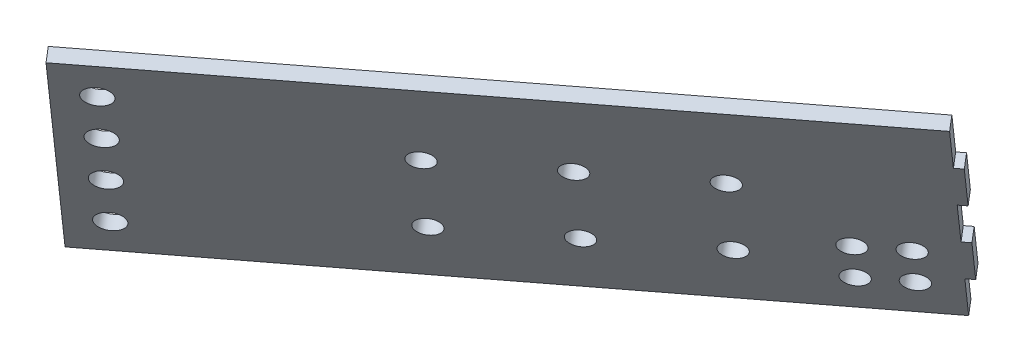
ISO-10303-21;
HEADER;
FILE_DESCRIPTION(('STEP AP214'),'2;1');
FILE_NAME('part.step','',(''),(''),'','','');
FILE_SCHEMA(('AUTOMOTIVE_DESIGN { 1 0 10303 214 1 1 1 1 }'));
ENDSEC;
DATA;
#1=APPLICATION_CONTEXT('core data for automotive mechanical design processes');
#2=APPLICATION_PROTOCOL_DEFINITION('international standard','automotive_design',2000,#1);
#3=PRODUCT_CONTEXT('',#1,'mechanical');
#4=PRODUCT('Part','Part','',(#3));
#5=PRODUCT_RELATED_PRODUCT_CATEGORY('part','',(#4));
#6=PRODUCT_DEFINITION_FORMATION('','',#4);
#7=PRODUCT_DEFINITION_CONTEXT('part definition',#1,'design');
#8=PRODUCT_DEFINITION('design','',#6,#7);
#9=PRODUCT_DEFINITION_SHAPE('','',#8);
#10=(LENGTH_UNIT() NAMED_UNIT(*) SI_UNIT(.MILLI.,.METRE.));
#11=(NAMED_UNIT(*) PLANE_ANGLE_UNIT() SI_UNIT($,.RADIAN.));
#12=(NAMED_UNIT(*) SI_UNIT($,.STERADIAN.) SOLID_ANGLE_UNIT());
#13=UNCERTAINTY_MEASURE_WITH_UNIT(LENGTH_MEASURE(1.E-05),#10,'distance_accuracy_value','');
#14=(GEOMETRIC_REPRESENTATION_CONTEXT(3) GLOBAL_UNCERTAINTY_ASSIGNED_CONTEXT((#13)) GLOBAL_UNIT_ASSIGNED_CONTEXT((#10,
#11,#12)) REPRESENTATION_CONTEXT('',''));
#15=CARTESIAN_POINT('',(0.,0.,0.));
#16=DIRECTION('',(0.,0.,1.));
#17=DIRECTION('',(1.,0.,0.));
#18=AXIS2_PLACEMENT_3D('',#15,#16,#17);
#19=CARTESIAN_POINT('',(-14.5467046392581,44.45,-33.02));
#20=DIRECTION('',(-0.79335334029123,0.,0.608761429008727));
#21=DIRECTION('',(-0.247605580069034,-0.913545457642603,-0.322685874403024));
#22=AXIS2_PLACEMENT_3D('',#19,#20,#21);
#23=PLANE('',#22);
#24=DIRECTION('',(-0.556131238258943,0.406736643075794,-0.72476434032864));
#25=VECTOR('',#24,1.);
#26=CARTESIAN_POINT('',(-8.75342284130713,36.2336291981627,-25.4700481688912));
#27=LINE('',#26,#25);
#28=CARTESIAN_POINT('',(-15.4468292939168,41.1289731097893,-34.193065288671));
#29=VERTEX_POINT('',#28);
#30=CARTESIAN_POINT('',(-17.1136658412265,42.3480441764161,-36.365328969504));
#31=VERTEX_POINT('',#30);
#32=EDGE_CURVE('E149',#29,#31,#27,.T.);
#33=ORIENTED_EDGE('',*,*,#32,.T.);
#34=DIRECTION('',(0.247605580069033,0.913545457642604,0.322685874403023));
#35=VECTOR('',#34,1.);
#36=CARTESIAN_POINT('',(-22.7379885264077,21.5969995516098,-43.6950889978784));
#37=LINE('',#36,#35);
#38=CARTESIAN_POINT('',(-14.3267866664418,52.6302874538634,-32.733397317882));
#39=VERTEX_POINT('',#38);
#40=EDGE_CURVE('E178',#39,#31,#37,.F.);
#41=ORIENTED_EDGE('',*,*,#40,.F.);
#42=DIRECTION('',(0.556131238258943,-0.406736643075794,0.72476434032864));
#43=VECTOR('',#42,1.);
#44=CARTESIAN_POINT('',(-12.6599501191321,51.4112163872367,-30.561133637049));
#45=LINE('',#44,#43);
#46=CARTESIAN_POINT('',(-12.6599501191321,51.4112163872367,-30.561133637049));
#47=VERTEX_POINT('',#46);
#48=EDGE_CURVE('E53',#39,#47,#45,.T.);
#49=ORIENTED_EDGE('',*,*,#48,.T.);
#50=DIRECTION('',(-0.247605580069034,-0.913545457642603,-0.322685874403024));
#51=VECTOR('',#50,1.);
#52=CARTESIAN_POINT('',(-14.5467046392581,44.45,-33.02));
#53=LINE('',#52,#51);
#54=EDGE_CURVE('E142',#47,#29,#53,.T.);
#55=ORIENTED_EDGE('',*,*,#54,.T.);
#56=EDGE_LOOP('',(#33,#41,#49,#55));
#57=FACE_BOUND('',#56,.T.);
#58=ADVANCED_FACE('F43',(#57),#23,.F.);
#59=DIRECTION('',(-0.556131238258943,0.406736643075794,-0.72476434032864));
#60=VECTOR('',#59,1.);
#61=CARTESIAN_POINT('',(-11.5403020160918,25.9513859207153,-29.1019798205133));
#62=LINE('',#61,#60);
#63=CARTESIAN_POINT('',(-18.2337084687014,30.846729832342,-37.8249969402931));
#64=VERTEX_POINT('',#63);
#65=CARTESIAN_POINT('',(-19.9005450160111,32.0658008989688,-39.9972606211261));
#66=VERTEX_POINT('',#65);
#67=EDGE_CURVE('E222',#64,#66,#62,.T.);
#68=ORIENTED_EDGE('',*,*,#67,.F.);
#69=CARTESIAN_POINT('',(-21.020587643486,20.5644865548946,-41.4569285919151));
#70=VERTEX_POINT('',#69);
#71=EDGE_CURVE('E47',#64,#70,#53,.T.);
#72=ORIENTED_EDGE('',*,*,#71,.T.);
#73=DIRECTION('',(-0.556131238258943,0.406736643075794,-0.72476434032864));
#74=VECTOR('',#73,1.);
#75=CARTESIAN_POINT('',(-14.3271811908764,15.669142643268,-32.7339114721353));
#76=LINE('',#75,#74);
#77=CARTESIAN_POINT('',(-22.6874241907957,21.7835576215214,-43.6291922727481));
#78=VERTEX_POINT('',#77);
#79=EDGE_CURVE('E205',#70,#78,#76,.T.);
#80=ORIENTED_EDGE('',*,*,#79,.T.);
#81=EDGE_CURVE('E180',#66,#78,#37,.F.);
#82=ORIENTED_EDGE('',*,*,#81,.F.);
#83=EDGE_LOOP('',(#68,#72,#80,#82));
#84=FACE_BOUND('',#83,.T.);
#85=ADVANCED_FACE('F357',(#84),#23,.F.);
#86=DIRECTION('',(-0.556131238258943,0.406736643075794,-0.72476434032864));
#87=VECTOR('',#86,1.);
#88=CARTESIAN_POINT('',(-17.114060365661,5.38689936582066,-36.3658431237573));
#89=LINE('',#88,#87);
#90=CARTESIAN_POINT('',(-23.8074668182706,10.2822432774473,-45.0888602435371));
#91=VERTEX_POINT('',#90);
#92=CARTESIAN_POINT('',(-25.4743033655803,11.5013143440741,-47.2611239243701));
#93=VERTEX_POINT('',#92);
#94=EDGE_CURVE('E202',#91,#93,#89,.T.);
#95=ORIENTED_EDGE('',*,*,#94,.F.);
#96=CARTESIAN_POINT('',(-26.5943459930553,0.,-48.7207918951591));
#97=VERTEX_POINT('',#96);
#98=EDGE_CURVE('E163',#91,#97,#53,.T.);
#99=ORIENTED_EDGE('',*,*,#98,.T.);
#100=DIRECTION('',(0.556131238258943,-0.406736643075794,0.72476434032864));
#101=VECTOR('',#100,1.);
#102=CARTESIAN_POINT('',(-26.5943459930553,0.,-48.7207918951591));
#103=LINE('',#102,#101);
#104=CARTESIAN_POINT('',(-28.261182540365,1.21907106662677,-50.8930555759921));
#105=VERTEX_POINT('',#104);
#106=EDGE_CURVE('E11',#105,#97,#103,.T.);
#107=ORIENTED_EDGE('',*,*,#106,.F.);
#108=EDGE_CURVE('E176',#93,#105,#37,.F.);
#109=ORIENTED_EDGE('',*,*,#108,.F.);
#110=EDGE_LOOP('',(#95,#99,#107,#109));
#111=FACE_BOUND('',#110,.T.);
#112=ADVANCED_FACE('F340',(#111),#23,.F.);
#113=CARTESIAN_POINT('',(-150.825537827718,51.4112163872366,75.4570506217247));
#114=DIRECTION('',(0.247605580069033,0.913545457642604,0.322685874403023));
#115=DIRECTION('',(-0.793353340291231,0.,0.608761429008727));
#116=AXIS2_PLACEMENT_3D('',#113,#114,#115);
#117=PLANE('',#116);
#118=DIRECTION('',(-0.556131238258943,0.406736643075795,-0.72476434032864));
#119=VECTOR('',#118,1.);
#120=CARTESIAN_POINT('',(31.9766845844257,-64.1354295160414,262.308313646661));
#121=LINE('',#120,#119);
#122=CARTESIAN_POINT('',(-126.010308613242,51.4112163872367,56.4156555325728));
#123=VERTEX_POINT('',#122);
#124=CARTESIAN_POINT('',(-127.677145160551,52.6302874538634,54.2433918517398));
#125=VERTEX_POINT('',#124);
#126=EDGE_CURVE('E197',#123,#125,#121,.T.);
#127=ORIENTED_EDGE('',*,*,#126,.F.);
#128=DIRECTION('',(-0.793353340291231,0.,0.608761429008727));
#129=VECTOR('',#128,1.);
#130=CARTESIAN_POINT('',(-150.825537827718,51.4112163872366,75.4570506217247));
#131=LINE('',#130,#129);
#132=EDGE_CURVE('E160',#47,#123,#131,.T.);
#133=ORIENTED_EDGE('',*,*,#132,.F.);
#134=ORIENTED_EDGE('',*,*,#48,.F.);
#135=DIRECTION('',(0.79335334029123,0.,-0.608761429008727));
#136=VECTOR('',#135,1.);
#137=CARTESIAN_POINT('',(-21.1183876367849,52.6302874538634,-27.5220186017536));
#138=LINE('',#137,#136);
#139=EDGE_CURVE('E179',#39,#125,#138,.F.);
#140=ORIENTED_EDGE('',*,*,#139,.T.);
#141=EDGE_LOOP('',(#127,#133,#134,#140));
#142=FACE_BOUND('',#141,.T.);
#143=ADVANCED_FACE('F379',(#142),#117,.T.);
#144=CARTESIAN_POINT('',(-33.3859469633983,0.,-43.5094131790307));
#145=DIRECTION('',(-0.247605580069033,-0.913545457642604,-0.322685874403023));
#146=DIRECTION('',(0.79335334029123,0.,-0.608761429008727));
#147=AXIS2_PLACEMENT_3D('',#144,#145,#146);
#148=PLANE('',#147);
#149=DIRECTION('',(0.79335334029123,0.,-0.608761429008727));
#150=VECTOR('',#149,1.);
#151=CARTESIAN_POINT('',(-35.052783510708,1.21907106662677,-45.6816768598637));
#152=LINE('',#151,#150);
#153=CARTESIAN_POINT('',(-141.611541034475,1.21907106662672,36.0837335936297));
#154=VERTEX_POINT('',#153);
#155=EDGE_CURVE('E173',#154,#105,#152,.T.);
#156=ORIENTED_EDGE('',*,*,#155,.T.);
#157=ORIENTED_EDGE('',*,*,#106,.T.);
#158=DIRECTION('',(0.79335334029123,0.,-0.608761429008727));
#159=VECTOR('',#158,1.);
#160=CARTESIAN_POINT('',(-33.3859469633983,0.,-43.5094131790307));
#161=LINE('',#160,#159);
#162=CARTESIAN_POINT('',(-139.944704487165,0.,38.2559972744627));
#163=VERTEX_POINT('',#162);
#164=EDGE_CURVE('E165',#163,#97,#161,.T.);
#165=ORIENTED_EDGE('',*,*,#164,.F.);
#166=DIRECTION('',(-0.556131238258943,0.406736643075795,-0.72476434032864));
#167=VECTOR('',#166,1.);
#168=CARTESIAN_POINT('',(18.0422887105026,-115.546645903278,244.14865538855));
#169=LINE('',#168,#167);
#170=EDGE_CURVE('E190',#163,#154,#169,.T.);
#171=ORIENTED_EDGE('',*,*,#170,.T.);
#172=EDGE_LOOP('',(#156,#157,#165,#171));
#173=FACE_BOUND('',#172,.T.);
#174=ADVANCED_FACE('F45',(#173),#148,.T.);
#175=CARTESIAN_POINT('',(-27.862752949441,20.3779284849831,-36.3114466009171));
#176=DIRECTION('',(0.556131238258943,-0.406736643075794,0.72476434032864));
#177=DIRECTION('',(0.79335334029123,0.,-0.608761429008727));
#178=AXIS2_PLACEMENT_3D('',#175,#176,#177);
#179=PLANE('',#178);
#180=CARTESIAN_POINT('',(-46.8476183837827,31.9778206395344,-15.2340051939125));
#181=DIRECTION('',(0.556131238258943,-0.406736643075794,0.72476434032864));
#182=DIRECTION('',(0.79335334029123,0.,-0.608761429008727));
#183=AXIS2_PLACEMENT_3D('',#180,#181,#182);
#184=CIRCLE('',#183,2.55269999999999);
#185=CARTESIAN_POINT('',(-44.8224253120213,31.9778206395344,-16.787990493743));
#186=VERTEX_POINT('',#185);
#187=EDGE_CURVE('E234',#186,#186,#184,.T.);
#188=ORIENTED_EDGE('',*,*,#187,.F.);
#189=EDGE_LOOP('',(#188));
#190=FACE_BOUND('',#189,.T.);
#191=CARTESIAN_POINT('',(-71.0225798720128,13.4145769402367,-7.10156887980129));
#192=DIRECTION('',(0.556131238258943,-0.406736643075794,0.72476434032864));
#193=DIRECTION('',(0.79335334029123,0.,-0.608761429008727));
#194=AXIS2_PLACEMENT_3D('',#191,#192,#193);
#195=CIRCLE('',#194,2.55269999999995);
#196=CARTESIAN_POINT('',(-68.9973868002514,13.4145769402367,-8.65555417963184));
#197=VERTEX_POINT('',#196);
#198=EDGE_CURVE('E239',#197,#197,#195,.T.);
#199=ORIENTED_EDGE('',*,*,#198,.F.);
#200=EDGE_LOOP('',(#199));
#201=FACE_BOUND('',#200,.T.);
#202=CARTESIAN_POINT('',(-85.1348502940503,31.9778206395344,14.1448211458456));
#203=DIRECTION('',(0.556131238258943,-0.406736643075794,0.72476434032864));
#204=DIRECTION('',(0.79335334029123,0.,-0.608761429008727));
#205=AXIS2_PLACEMENT_3D('',#202,#203,#204);
#206=CIRCLE('',#205,2.55269999999986);
#207=CARTESIAN_POINT('',(-83.109657222289,31.9778206395344,12.5908358460151));
#208=VERTEX_POINT('',#207);
#209=EDGE_CURVE('E242',#208,#208,#206,.T.);
#210=ORIENTED_EDGE('',*,*,#209,.F.);
#211=EDGE_LOOP('',(#210));
#212=FACE_BOUND('',#211,.T.);
#213=CARTESIAN_POINT('',(-65.9912344850101,31.9778206395344,-0.544591911931874));
#214=DIRECTION('',(0.556131238258943,-0.406736643075794,0.72476434032864));
#215=DIRECTION('',(0.79335334029123,0.,-0.608761429008727));
#216=AXIS2_PLACEMENT_3D('',#213,#214,#215);
#217=CIRCLE('',#216,2.55269999999995);
#218=CARTESIAN_POINT('',(-63.9660414132487,31.9778206395344,-2.09857721176242));
#219=VERTEX_POINT('',#218);
#220=EDGE_CURVE('E245',#219,#219,#217,.T.);
#221=ORIENTED_EDGE('',*,*,#220,.F.);
#222=EDGE_LOOP('',(#221));
#223=FACE_BOUND('',#222,.T.);
#224=CARTESIAN_POINT('',(-125.408956693522,31.325473742774,44.6821338187698));
#225=DIRECTION('',(0.556131238258943,-0.406736643075794,0.72476434032864));
#226=DIRECTION('',(0.79335334029123,0.,-0.608761429008727));
#227=AXIS2_PLACEMENT_3D('',#224,#225,#226);
#228=CIRCLE('',#227,2.79400000000009);
#229=CARTESIAN_POINT('',(-123.192327460748,31.325473742774,42.9812543861193));
#230=VERTEX_POINT('',#229);
#231=EDGE_CURVE('E248',#230,#230,#228,.T.);
#232=ORIENTED_EDGE('',*,*,#231,.F.);
#233=EDGE_LOOP('',(#232));
#234=FACE_BOUND('',#233,.T.);
#235=CARTESIAN_POINT('',(-128.553547560399,19.7234464307129,40.5840232138514));
#236=DIRECTION('',(0.556131238258943,-0.406736643075794,0.72476434032864));
#237=DIRECTION('',(0.79335334029123,0.,-0.608761429008727));
#238=AXIS2_PLACEMENT_3D('',#235,#236,#237);
#239=CIRCLE('',#238,2.79400000000003);
#240=CARTESIAN_POINT('',(-126.336918327625,19.7234464307129,38.8831437812009));
#241=VERTEX_POINT('',#240);
#242=EDGE_CURVE('E251',#241,#241,#239,.T.);
#243=ORIENTED_EDGE('',*,*,#242,.F.);
#244=EDGE_LOOP('',(#243));
#245=FACE_BOUND('',#244,.T.);
#246=CARTESIAN_POINT('',(-51.8789637707854,13.4145769402367,-21.7909821617819));
#247=DIRECTION('',(0.556131238258943,-0.406736643075794,0.72476434032864));
#248=DIRECTION('',(0.79335334029123,0.,-0.608761429008727));
#249=AXIS2_PLACEMENT_3D('',#246,#247,#248);
#250=CIRCLE('',#249,2.55269999999998);
#251=CARTESIAN_POINT('',(-49.853770699024,13.4145769402367,-23.3449674616124));
#252=VERTEX_POINT('',#251);
#253=EDGE_CURVE('E254',#252,#252,#250,.T.);
#254=ORIENTED_EDGE('',*,*,#253,.F.);
#255=EDGE_LOOP('',(#254));
#256=FACE_BOUND('',#255,.T.);
#257=CARTESIAN_POINT('',(-122.264365826645,42.9275010548351,48.7802444236881));
#258=DIRECTION('',(0.556131238258943,-0.406736643075794,0.72476434032864));
#259=DIRECTION('',(0.79335334029123,0.,-0.608761429008727));
#260=AXIS2_PLACEMENT_3D('',#257,#258,#259);
#261=CIRCLE('',#260,2.79400000000011);
#262=CARTESIAN_POINT('',(-120.047736593871,42.9275010548351,47.0793649910377));
#263=VERTEX_POINT('',#262);
#264=EDGE_CURVE('E257',#263,#263,#261,.T.);
#265=ORIENTED_EDGE('',*,*,#264,.F.);
#266=EDGE_LOOP('',(#265));
#267=FACE_BOUND('',#266,.T.);
#268=CARTESIAN_POINT('',(-30.6432056618001,8.29544952812365,-40.9585989698857));
#269=DIRECTION('',(0.556131238258943,-0.406736643075794,0.72476434032864));
#270=DIRECTION('',(0.79335334029123,0.,-0.608761429008727));
#271=AXIS2_PLACEMENT_3D('',#268,#269,#270);
#272=CIRCLE('',#271,2.55269999999989);
#273=CARTESIAN_POINT('',(-28.6180125900387,8.29544952812365,-42.5125842697162));
#274=VERTEX_POINT('',#273);
#275=EDGE_CURVE('E260',#274,#274,#272,.T.);
#276=ORIENTED_EDGE('',*,*,#275,.F.);
#277=EDGE_LOOP('',(#276));
#278=FACE_BOUND('',#277,.T.);
#279=CARTESIAN_POINT('',(-28.2847625116426,16.9969700121695,-37.8850160161969));
#280=DIRECTION('',(0.556131238258943,-0.406736643075794,0.72476434032864));
#281=DIRECTION('',(0.79335334029123,0.,-0.608761429008727));
#282=AXIS2_PLACEMENT_3D('',#279,#280,#281);
#283=CIRCLE('',#282,2.55269999999996);
#284=CARTESIAN_POINT('',(-26.2595694398812,16.9969700121695,-39.4390013160275));
#285=VERTEX_POINT('',#284);
#286=EDGE_CURVE('E263',#285,#285,#283,.T.);
#287=ORIENTED_EDGE('',*,*,#286,.F.);
#288=EDGE_LOOP('',(#287));
#289=FACE_BOUND('',#288,.T.);
#290=CARTESIAN_POINT('',(-90.1661947951034,13.4145769402367,7.5878434981631));
#291=DIRECTION('',(0.556131238258943,-0.406736643075794,0.72476434032864));
#292=DIRECTION('',(0.79335334029123,0.,-0.608761429008727));
#293=AXIS2_PLACEMENT_3D('',#290,#291,#292);
#294=CIRCLE('',#293,2.55270000000002);
#295=CARTESIAN_POINT('',(-88.1410017233419,13.4145769402367,6.03385819833252));
#296=VERTEX_POINT('',#295);
#297=EDGE_CURVE('E266',#296,#296,#294,.T.);
#298=ORIENTED_EDGE('',*,*,#297,.F.);
#299=EDGE_LOOP('',(#298));
#300=FACE_BOUND('',#299,.T.);
#301=CARTESIAN_POINT('',(-38.199896228074,8.29544952812365,-35.1601463585776));
#302=DIRECTION('',(0.556131238258943,-0.406736643075794,0.72476434032864));
#303=DIRECTION('',(0.79335334029123,0.,-0.608761429008727));
#304=AXIS2_PLACEMENT_3D('',#301,#302,#303);
#305=CIRCLE('',#304,2.55269999999989);
#306=CARTESIAN_POINT('',(-36.1747031563127,8.29544952812365,-36.7141316584081));
#307=VERTEX_POINT('',#306);
#308=EDGE_CURVE('E269',#307,#307,#305,.T.);
#309=ORIENTED_EDGE('',*,*,#308,.F.);
#310=EDGE_LOOP('',(#309));
#311=FACE_BOUND('',#310,.T.);
#312=CARTESIAN_POINT('',(-35.8414530779165,16.9969700121695,-32.0865634048888));
#313=DIRECTION('',(0.556131238258943,-0.406736643075794,0.72476434032864));
#314=DIRECTION('',(0.79335334029123,0.,-0.608761429008727));
#315=AXIS2_PLACEMENT_3D('',#312,#313,#314);
#316=CIRCLE('',#315,2.55269999999996);
#317=CARTESIAN_POINT('',(-33.8162600061552,16.9969700121695,-33.6405487047194));
#318=VERTEX_POINT('',#317);
#319=EDGE_CURVE('E272',#318,#318,#316,.T.);
#320=ORIENTED_EDGE('',*,*,#319,.F.);
#321=EDGE_LOOP('',(#320));
#322=FACE_BOUND('',#321,.T.);
#323=CARTESIAN_POINT('',(-131.698138427275,8.12141911865187,36.485912608933));
#324=DIRECTION('',(0.556131238258943,-0.406736643075794,0.72476434032864));
#325=DIRECTION('',(0.79335334029123,0.,-0.608761429008727));
#326=AXIS2_PLACEMENT_3D('',#323,#324,#325);
#327=CIRCLE('',#326,2.79399999999997);
#328=CARTESIAN_POINT('',(-129.481509194502,8.12141911865187,34.7850331762826));
#329=VERTEX_POINT('',#328);
#330=EDGE_CURVE('E275',#329,#329,#327,.T.);
#331=ORIENTED_EDGE('',*,*,#330,.F.);
#332=EDGE_LOOP('',(#331));
#333=FACE_BOUND('',#332,.T.);
#334=DIRECTION('',(0.247605580069033,0.913545457642604,0.322685874403023));
#335=VECTOR('',#334,1.);
#336=CARTESIAN_POINT('',(-134.421510473207,20.3779284849831,45.4539638525764));
#337=LINE('',#336,#335);
#338=EDGE_CURVE('E177',#163,#123,#337,.T.);
#339=ORIENTED_EDGE('',*,*,#338,.F.);
#340=ORIENTED_EDGE('',*,*,#164,.T.);
#341=ORIENTED_EDGE('',*,*,#98,.F.);
#342=DIRECTION('',(-0.793353340291234,0.,0.608761429008722));
#343=VECTOR('',#342,1.);
#344=CARTESIAN_POINT('',(-23.8074668182706,10.2822432774473,-45.0888602435371));
#345=LINE('',#344,#343);
#346=CARTESIAN_POINT('',(-22.4425749961696,10.2822432774473,-46.136178574307));
#347=VERTEX_POINT('',#346);
#348=EDGE_CURVE('E204',#347,#91,#345,.T.);
#349=ORIENTED_EDGE('',*,*,#348,.F.);
#350=DIRECTION('',(-0.247605580069034,-0.913545457642604,-0.322685874403022));
#351=VECTOR('',#350,1.);
#352=CARTESIAN_POINT('',(-22.4425749961696,10.2822432774473,-46.136178574307));
#353=LINE('',#352,#351);
#354=CARTESIAN_POINT('',(-19.655695821385,20.5644865548946,-42.504246922685));
#355=VERTEX_POINT('',#354);
#356=EDGE_CURVE('E212',#355,#347,#353,.T.);
#357=ORIENTED_EDGE('',*,*,#356,.F.);
#358=DIRECTION('',(0.793353340291232,0.,-0.608761429008725));
#359=VECTOR('',#358,1.);
#360=CARTESIAN_POINT('',(-21.020587643486,20.5644865548946,-41.4569285919151));
#361=LINE('',#360,#359);
#362=EDGE_CURVE('E208',#70,#355,#361,.T.);
#363=ORIENTED_EDGE('',*,*,#362,.F.);
#364=ORIENTED_EDGE('',*,*,#71,.F.);
#365=DIRECTION('',(-0.79335334029123,0.,0.608761429008727));
#366=VECTOR('',#365,1.);
#367=CARTESIAN_POINT('',(-18.2337084687014,30.846729832342,-37.8249969402931));
#368=LINE('',#367,#366);
#369=CARTESIAN_POINT('',(-16.8688166466003,30.846729832342,-38.872315271063));
#370=VERTEX_POINT('',#369);
#371=EDGE_CURVE('E226',#370,#64,#368,.T.);
#372=ORIENTED_EDGE('',*,*,#371,.F.);
#373=DIRECTION('',(-0.247605580069032,-0.913545457642604,-0.322685874403024));
#374=VECTOR('',#373,1.);
#375=CARTESIAN_POINT('',(-16.8688166466003,30.846729832342,-38.872315271063));
#376=LINE('',#375,#374);
#377=CARTESIAN_POINT('',(-14.0819374718157,41.1289731097893,-35.240383619441));
#378=VERTEX_POINT('',#377);
#379=EDGE_CURVE('E145',#378,#370,#376,.T.);
#380=ORIENTED_EDGE('',*,*,#379,.F.);
#381=DIRECTION('',(0.793353340291232,0.,-0.608761429008724));
#382=VECTOR('',#381,1.);
#383=CARTESIAN_POINT('',(-15.4468292939168,41.1289731097893,-34.193065288671));
#384=LINE('',#383,#382);
#385=EDGE_CURVE('E136',#29,#378,#384,.T.);
#386=ORIENTED_EDGE('',*,*,#385,.F.);
#387=ORIENTED_EDGE('',*,*,#54,.F.);
#388=ORIENTED_EDGE('',*,*,#132,.T.);
#389=EDGE_LOOP('',(#339,#340,#341,#349,#357,#363,#364,#372,#380,#386,#387,#388));
#390=FACE_BOUND('',#389,.T.);
#391=ADVANCED_FACE('F139',(#190,#201,#212,#223,#234,#245,#256,#267,#278,#289,#300,#311,#322,
#333,#390),#179,.T.);
#392=CARTESIAN_POINT('',(-29.5295894967507,21.5969995516098,-38.4837102817501));
#393=DIRECTION('',(0.556131238258943,-0.406736643075794,0.72476434032864));
#394=DIRECTION('',(0.79335334029123,0.,-0.608761429008727));
#395=AXIS2_PLACEMENT_3D('',#392,#393,#394);
#396=PLANE('',#395);
#397=CARTESIAN_POINT('',(-48.5144549310924,33.1968917061611,-17.4062688747455));
#398=DIRECTION('',(-0.556131238258943,0.406736643075794,-0.72476434032864));
#399=DIRECTION('',(-0.793353340291231,0.,0.608761429008727));
#400=AXIS2_PLACEMENT_3D('',#397,#398,#399);
#401=CIRCLE('',#400,2.55269999999999);
#402=CARTESIAN_POINT('',(-50.5396480028538,33.1968917061611,-15.8522835749149));
#403=VERTEX_POINT('',#402);
#404=EDGE_CURVE('E296',#403,#403,#401,.T.);
#405=ORIENTED_EDGE('',*,*,#404,.F.);
#406=EDGE_LOOP('',(#405));
#407=FACE_BOUND('',#406,.T.);
#408=CARTESIAN_POINT('',(-72.6894164193225,14.6336480068634,-9.27383256063431));
#409=DIRECTION('',(-0.556131238258943,0.406736643075794,-0.72476434032864));
#410=DIRECTION('',(-0.793353340291231,0.,0.608761429008727));
#411=AXIS2_PLACEMENT_3D('',#408,#409,#410);
#412=CIRCLE('',#411,2.55269999999995);
#413=CARTESIAN_POINT('',(-74.7146094910839,14.6336480068634,-7.71984726080376));
#414=VERTEX_POINT('',#413);
#415=EDGE_CURVE('E293',#414,#414,#412,.T.);
#416=ORIENTED_EDGE('',*,*,#415,.F.);
#417=EDGE_LOOP('',(#416));
#418=FACE_BOUND('',#417,.T.);
#419=CARTESIAN_POINT('',(-86.8016868413599,33.1968917061611,11.9725574650126));
#420=DIRECTION('',(-0.556131238258943,0.406736643075794,-0.72476434032864));
#421=DIRECTION('',(-0.793353340291231,0.,0.608761429008727));
#422=AXIS2_PLACEMENT_3D('',#419,#420,#421);
#423=CIRCLE('',#422,2.55269999999986);
#424=CARTESIAN_POINT('',(-88.8268799131213,33.1968917061611,13.5265427648431));
#425=VERTEX_POINT('',#424);
#426=EDGE_CURVE('E302',#425,#425,#423,.T.);
#427=ORIENTED_EDGE('',*,*,#426,.F.);
#428=EDGE_LOOP('',(#427));
#429=FACE_BOUND('',#428,.T.);
#430=CARTESIAN_POINT('',(-67.6580710323198,33.1968917061611,-2.71685559276487));
#431=DIRECTION('',(-0.556131238258943,0.406736643075794,-0.72476434032864));
#432=DIRECTION('',(-0.793353340291231,0.,0.608761429008727));
#433=AXIS2_PLACEMENT_3D('',#430,#431,#432);
#434=CIRCLE('',#433,2.55269999999995);
#435=CARTESIAN_POINT('',(-69.6832641040812,33.1968917061611,-1.16287029293432));
#436=VERTEX_POINT('',#435);
#437=EDGE_CURVE('E299',#436,#436,#434,.T.);
#438=ORIENTED_EDGE('',*,*,#437,.F.);
#439=EDGE_LOOP('',(#438));
#440=FACE_BOUND('',#439,.T.);
#441=CARTESIAN_POINT('',(-127.075793240832,32.5445448094008,42.5098701379367));
#442=DIRECTION('',(-0.556131238258943,0.406736643075794,-0.72476434032864));
#443=DIRECTION('',(-0.793353340291231,0.,0.608761429008727));
#444=AXIS2_PLACEMENT_3D('',#441,#442,#443);
#445=CIRCLE('',#444,2.79400000000009);
#446=CARTESIAN_POINT('',(-129.292422473605,32.5445448094008,44.2107495705872));
#447=VERTEX_POINT('',#446);
#448=EDGE_CURVE('E284',#447,#447,#445,.T.);
#449=ORIENTED_EDGE('',*,*,#448,.F.);
#450=EDGE_LOOP('',(#449));
#451=FACE_BOUND('',#450,.T.);
#452=CARTESIAN_POINT('',(-130.220384107708,20.9425174973397,38.4117595330183));
#453=DIRECTION('',(-0.556131238258943,0.406736643075794,-0.72476434032864));
#454=DIRECTION('',(-0.793353340291231,0.,0.608761429008727));
#455=AXIS2_PLACEMENT_3D('',#452,#453,#454);
#456=CIRCLE('',#455,2.79400000000003);
#457=CARTESIAN_POINT('',(-132.437013340482,20.9425174973397,40.1126389656688));
#458=VERTEX_POINT('',#457);
#459=EDGE_CURVE('E281',#458,#458,#456,.T.);
#460=ORIENTED_EDGE('',*,*,#459,.F.);
#461=EDGE_LOOP('',(#460));
#462=FACE_BOUND('',#461,.T.);
#463=CARTESIAN_POINT('',(-53.5458003180951,14.6336480068634,-23.9632458426149));
#464=DIRECTION('',(-0.556131238258943,0.406736643075794,-0.72476434032864));
#465=DIRECTION('',(-0.793353340291231,0.,0.608761429008727));
#466=AXIS2_PLACEMENT_3D('',#463,#464,#465);
#467=CIRCLE('',#466,2.55269999999998);
#468=CARTESIAN_POINT('',(-55.5709933898565,14.6336480068634,-22.4092605427843));
#469=VERTEX_POINT('',#468);
#470=EDGE_CURVE('E290',#469,#469,#467,.T.);
#471=ORIENTED_EDGE('',*,*,#470,.F.);
#472=EDGE_LOOP('',(#471));
#473=FACE_BOUND('',#472,.T.);
#474=CARTESIAN_POINT('',(-123.931202373955,44.1465721214618,46.6079807428551));
#475=DIRECTION('',(-0.556131238258943,0.406736643075794,-0.72476434032864));
#476=DIRECTION('',(-0.793353340291231,0.,0.608761429008727));
#477=AXIS2_PLACEMENT_3D('',#474,#475,#476);
#478=CIRCLE('',#477,2.79400000000011);
#479=CARTESIAN_POINT('',(-126.147831606729,44.1465721214618,48.3088601755056));
#480=VERTEX_POINT('',#479);
#481=EDGE_CURVE('E287',#480,#480,#478,.T.);
#482=ORIENTED_EDGE('',*,*,#481,.F.);
#483=EDGE_LOOP('',(#482));
#484=FACE_BOUND('',#483,.T.);
#485=CARTESIAN_POINT('',(-32.3100422091098,9.51452059475042,-43.1308626507187));
#486=DIRECTION('',(-0.556131238258943,0.406736643075794,-0.72476434032864));
#487=DIRECTION('',(-0.793353340291231,0.,0.608761429008727));
#488=AXIS2_PLACEMENT_3D('',#485,#486,#487);
#489=CIRCLE('',#488,2.55269999999989);
#490=CARTESIAN_POINT('',(-34.3352352808711,9.51452059475042,-41.5768773508882));
#491=VERTEX_POINT('',#490);
#492=EDGE_CURVE('E317',#491,#491,#489,.T.);
#493=ORIENTED_EDGE('',*,*,#492,.F.);
#494=EDGE_LOOP('',(#493));
#495=FACE_BOUND('',#494,.T.);
#496=CARTESIAN_POINT('',(-29.9515990589522,18.2160410787962,-40.0572796970299));
#497=DIRECTION('',(-0.556131238258943,0.406736643075794,-0.72476434032864));
#498=DIRECTION('',(-0.793353340291231,0.,0.608761429008727));
#499=AXIS2_PLACEMENT_3D('',#496,#497,#498);
#500=CIRCLE('',#499,2.55269999999996);
#501=CARTESIAN_POINT('',(-31.9767921307136,18.2160410787962,-38.5032943971994));
#502=VERTEX_POINT('',#501);
#503=EDGE_CURVE('E308',#502,#502,#500,.T.);
#504=ORIENTED_EDGE('',*,*,#503,.F.);
#505=EDGE_LOOP('',(#504));
#506=FACE_BOUND('',#505,.T.);
#507=CARTESIAN_POINT('',(-91.8330313424131,14.6336480068634,5.4155798173301));
#508=DIRECTION('',(-0.556131238258943,0.406736643075794,-0.72476434032864));
#509=DIRECTION('',(-0.793353340291231,0.,0.608761429008727));
#510=AXIS2_PLACEMENT_3D('',#507,#508,#509);
#511=CIRCLE('',#510,2.55270000000002);
#512=CARTESIAN_POINT('',(-93.8582244141745,14.6336480068634,6.96956511716069));
#513=VERTEX_POINT('',#512);
#514=EDGE_CURVE('E305',#513,#513,#511,.T.);
#515=ORIENTED_EDGE('',*,*,#514,.F.);
#516=EDGE_LOOP('',(#515));
#517=FACE_BOUND('',#516,.T.);
#518=CARTESIAN_POINT('',(-39.8667327753838,9.51452059475042,-37.3324100394106));
#519=DIRECTION('',(-0.556131238258943,0.406736643075794,-0.72476434032864));
#520=DIRECTION('',(-0.793353340291231,0.,0.608761429008727));
#521=AXIS2_PLACEMENT_3D('',#518,#519,#520);
#522=CIRCLE('',#521,2.55269999999989);
#523=CARTESIAN_POINT('',(-41.8919258471451,9.51452059475042,-35.7784247395801));
#524=VERTEX_POINT('',#523);
#525=EDGE_CURVE('E314',#524,#524,#522,.T.);
#526=ORIENTED_EDGE('',*,*,#525,.F.);
#527=EDGE_LOOP('',(#526));
#528=FACE_BOUND('',#527,.T.);
#529=CARTESIAN_POINT('',(-37.5082896252262,18.2160410787962,-34.2588270857218));
#530=DIRECTION('',(-0.556131238258943,0.406736643075794,-0.72476434032864));
#531=DIRECTION('',(-0.793353340291231,0.,0.608761429008727));
#532=AXIS2_PLACEMENT_3D('',#529,#530,#531);
#533=CIRCLE('',#532,2.55269999999996);
#534=CARTESIAN_POINT('',(-39.5334826969876,18.2160410787962,-32.7048417858912));
#535=VERTEX_POINT('',#534);
#536=EDGE_CURVE('E311',#535,#535,#533,.T.);
#537=ORIENTED_EDGE('',*,*,#536,.F.);
#538=EDGE_LOOP('',(#537));
#539=FACE_BOUND('',#538,.T.);
#540=CARTESIAN_POINT('',(-133.364974974585,9.34049018527865,34.3136489281));
#541=DIRECTION('',(-0.556131238258943,0.406736643075794,-0.72476434032864));
#542=DIRECTION('',(-0.793353340291231,0.,0.608761429008727));
#543=AXIS2_PLACEMENT_3D('',#540,#541,#542);
#544=CIRCLE('',#543,2.79399999999997);
#545=CARTESIAN_POINT('',(-135.581604207359,9.34049018527865,36.0145283607503));
#546=VERTEX_POINT('',#545);
#547=EDGE_CURVE('E278',#546,#546,#544,.T.);
#548=ORIENTED_EDGE('',*,*,#547,.F.);
#549=EDGE_LOOP('',(#548));
#550=FACE_BOUND('',#549,.T.);
#551=ORIENTED_EDGE('',*,*,#155,.F.);
#552=DIRECTION('',(-0.247605580069034,-0.913545457642603,-0.322685874403023));
#553=VECTOR('',#552,1.);
#554=CARTESIAN_POINT('',(-141.611541034475,1.21907106662672,36.0837335936297));
#555=LINE('',#554,#553);
#556=EDGE_CURVE('E196',#125,#154,#555,.T.);
#557=ORIENTED_EDGE('',*,*,#556,.F.);
#558=ORIENTED_EDGE('',*,*,#139,.F.);
#559=ORIENTED_EDGE('',*,*,#40,.T.);
#560=DIRECTION('',(0.793353340291231,0.,-0.608761429008726));
#561=VECTOR('',#560,1.);
#562=CARTESIAN_POINT('',(-17.1136658412265,42.3480441764161,-36.365328969504));
#563=LINE('',#562,#561);
#564=CARTESIAN_POINT('',(-15.7487740191254,42.3480441764161,-37.412647300274));
#565=VERTEX_POINT('',#564);
#566=EDGE_CURVE('E154',#31,#565,#563,.T.);
#567=ORIENTED_EDGE('',*,*,#566,.T.);
#568=DIRECTION('',(-0.247605580069032,-0.913545457642603,-0.322685874403024));
#569=VECTOR('',#568,1.);
#570=CARTESIAN_POINT('',(-18.53565319391,32.0658008989688,-41.044578951896));
#571=LINE('',#570,#569);
#572=CARTESIAN_POINT('',(-18.53565319391,32.0658008989688,-41.044578951896));
#573=VERTEX_POINT('',#572);
#574=EDGE_CURVE('E158',#565,#573,#571,.T.);
#575=ORIENTED_EDGE('',*,*,#574,.T.);
#576=DIRECTION('',(-0.79335334029123,0.,0.608761429008727));
#577=VECTOR('',#576,1.);
#578=CARTESIAN_POINT('',(-19.9005450160111,32.0658008989688,-39.9972606211261));
#579=LINE('',#578,#577);
#580=EDGE_CURVE('E61',#573,#66,#579,.T.);
#581=ORIENTED_EDGE('',*,*,#580,.T.);
#582=ORIENTED_EDGE('',*,*,#81,.T.);
#583=DIRECTION('',(0.793353340291232,0.,-0.608761429008725));
#584=VECTOR('',#583,1.);
#585=CARTESIAN_POINT('',(-22.6874241907957,21.7835576215214,-43.6291922727481));
#586=LINE('',#585,#584);
#587=CARTESIAN_POINT('',(-21.3225323686947,21.7835576215214,-44.676510603518));
#588=VERTEX_POINT('',#587);
#589=EDGE_CURVE('E221',#78,#588,#586,.T.);
#590=ORIENTED_EDGE('',*,*,#589,.T.);
#591=DIRECTION('',(-0.247605580069034,-0.913545457642604,-0.322685874403022));
#592=VECTOR('',#591,1.);
#593=CARTESIAN_POINT('',(-24.1094115434793,11.5013143440741,-48.30844225514));
#594=LINE('',#593,#592);
#595=CARTESIAN_POINT('',(-24.1094115434793,11.5013143440741,-48.30844225514));
#596=VERTEX_POINT('',#595);
#597=EDGE_CURVE('E209',#588,#596,#594,.T.);
#598=ORIENTED_EDGE('',*,*,#597,.T.);
#599=DIRECTION('',(-0.793353340291234,0.,0.608761429008722));
#600=VECTOR('',#599,1.);
#601=CARTESIAN_POINT('',(-25.4743033655804,11.5013143440741,-47.2611239243701));
#602=LINE('',#601,#600);
#603=EDGE_CURVE('E68',#596,#93,#602,.T.);
#604=ORIENTED_EDGE('',*,*,#603,.T.);
#605=ORIENTED_EDGE('',*,*,#108,.T.);
#606=EDGE_LOOP('',(#551,#557,#558,#559,#567,#575,#581,#582,#590,#598,#604,#605));
#607=FACE_BOUND('',#606,.T.);
#608=ADVANCED_FACE('F323',(#407,#418,#429,#440,#451,#462,#473,#484,#495,#506,#517,#528,#539,
#550,#607),#396,.F.);
#609=CARTESIAN_POINT('',(18.0422887105026,-115.546645903278,244.14865538855));
#610=DIRECTION('',(0.79335334029123,0.,-0.608761429008727));
#611=DIRECTION('',(-0.608761429008727,0.,-0.79335334029123));
#612=AXIS2_PLACEMENT_3D('',#609,#610,#611);
#613=PLANE('',#612);
#614=ORIENTED_EDGE('',*,*,#338,.T.);
#615=ORIENTED_EDGE('',*,*,#126,.T.);
#616=ORIENTED_EDGE('',*,*,#556,.T.);
#617=ORIENTED_EDGE('',*,*,#170,.F.);
#618=EDGE_LOOP('',(#614,#615,#616,#617));
#619=FACE_BOUND('',#618,.T.);
#620=ADVANCED_FACE('F194',(#619),#613,.F.);
#621=CARTESIAN_POINT('',(-14.3271811908764,15.669142643268,-32.7339114721353));
#622=DIRECTION('',(0.247605580069029,0.913545457642604,0.322685874403026));
#623=DIRECTION('',(0.,-0.333056962771195,0.94290670776574));
#624=AXIS2_PLACEMENT_3D('',#621,#622,#623);
#625=PLANE('',#624);
#626=ORIENTED_EDGE('',*,*,#79,.F.);
#627=ORIENTED_EDGE('',*,*,#362,.T.);
#628=DIRECTION('',(-0.556131238258943,0.406736643075794,-0.72476434032864));
#629=VECTOR('',#628,1.);
#630=CARTESIAN_POINT('',(-12.9622893687753,15.669142643268,-33.7812298029052));
#631=LINE('',#630,#629);
#632=EDGE_CURVE('E210',#355,#588,#631,.T.);
#633=ORIENTED_EDGE('',*,*,#632,.T.);
#634=ORIENTED_EDGE('',*,*,#589,.F.);
#635=EDGE_LOOP('',(#626,#627,#633,#634));
#636=FACE_BOUND('',#635,.T.);
#637=ADVANCED_FACE('F353',(#636),#625,.T.);
#638=CARTESIAN_POINT('',(-15.74916854356,5.38689936582069,-37.4131614545272));
#639=DIRECTION('',(0.79335334029123,0.,-0.608761429008727));
#640=DIRECTION('',(-0.608761429008727,0.,-0.79335334029123));
#641=AXIS2_PLACEMENT_3D('',#638,#639,#640);
#642=PLANE('',#641);
#643=ORIENTED_EDGE('',*,*,#632,.F.);
#644=ORIENTED_EDGE('',*,*,#356,.T.);
#645=DIRECTION('',(-0.556131238258943,0.406736643075794,-0.72476434032864));
#646=VECTOR('',#645,1.);
#647=CARTESIAN_POINT('',(-15.74916854356,5.38689936582069,-37.4131614545272));
#648=LINE('',#647,#646);
#649=EDGE_CURVE('E213',#347,#596,#648,.T.);
#650=ORIENTED_EDGE('',*,*,#649,.T.);
#651=ORIENTED_EDGE('',*,*,#597,.F.);
#652=EDGE_LOOP('',(#643,#644,#650,#651));
#653=FACE_BOUND('',#652,.T.);
#654=ADVANCED_FACE('F350',(#653),#642,.T.);
#655=CARTESIAN_POINT('',(-17.114060365661,5.38689936582066,-36.3658431237573));
#656=DIRECTION('',(-0.247605580069021,-0.913545457642604,-0.322685874403033));
#657=DIRECTION('',(0.,0.333056962771201,-0.942906707765738));
#658=AXIS2_PLACEMENT_3D('',#655,#656,#657);
#659=PLANE('',#658);
#660=ORIENTED_EDGE('',*,*,#649,.F.);
#661=ORIENTED_EDGE('',*,*,#348,.T.);
#662=ORIENTED_EDGE('',*,*,#94,.T.);
#663=ORIENTED_EDGE('',*,*,#603,.F.);
#664=EDGE_LOOP('',(#660,#661,#662,#663));
#665=FACE_BOUND('',#664,.T.);
#666=ADVANCED_FACE('F343',(#665),#659,.T.);
#667=CARTESIAN_POINT('',(-8.75342284130713,36.2336291981627,-25.4700481688912));
#668=DIRECTION('',(0.247605580069027,0.913545457642604,0.322685874403028));
#669=DIRECTION('',(0.,-0.333056962771197,0.942906707765739));
#670=AXIS2_PLACEMENT_3D('',#667,#668,#669);
#671=PLANE('',#670);
#672=ORIENTED_EDGE('',*,*,#32,.F.);
#673=ORIENTED_EDGE('',*,*,#385,.T.);
#674=DIRECTION('',(-0.556131238258943,0.406736643075794,-0.72476434032864));
#675=VECTOR('',#674,1.);
#676=CARTESIAN_POINT('',(-7.38853101920607,36.2336291981627,-26.5173664996612));
#677=LINE('',#676,#675);
#678=EDGE_CURVE('E148',#378,#565,#677,.T.);
#679=ORIENTED_EDGE('',*,*,#678,.T.);
#680=ORIENTED_EDGE('',*,*,#566,.F.);
#681=EDGE_LOOP('',(#672,#673,#679,#680));
#682=FACE_BOUND('',#681,.T.);
#683=ADVANCED_FACE('F152',(#682),#671,.T.);
#684=CARTESIAN_POINT('',(-10.1754101939907,25.9513859207153,-30.1492981512832));
#685=DIRECTION('',(0.793353340291231,0.,-0.608761429008726));
#686=DIRECTION('',(-0.608761429008726,0.,-0.793353340291231));
#687=AXIS2_PLACEMENT_3D('',#684,#685,#686);
#688=PLANE('',#687);
#689=ORIENTED_EDGE('',*,*,#678,.F.);
#690=ORIENTED_EDGE('',*,*,#379,.T.);
#691=DIRECTION('',(-0.556131238258943,0.406736643075794,-0.72476434032864));
#692=VECTOR('',#691,1.);
#693=CARTESIAN_POINT('',(-10.1754101939907,25.9513859207153,-30.1492981512832));
#694=LINE('',#693,#692);
#695=EDGE_CURVE('E229',#370,#573,#694,.T.);
#696=ORIENTED_EDGE('',*,*,#695,.T.);
#697=ORIENTED_EDGE('',*,*,#574,.F.);
#698=EDGE_LOOP('',(#689,#690,#696,#697));
#699=FACE_BOUND('',#698,.T.);
#700=ADVANCED_FACE('F363',(#699),#688,.T.);
#701=CARTESIAN_POINT('',(-11.5403020160918,25.9513859207153,-29.1019798205133));
#702=DIRECTION('',(-0.247605580069033,-0.913545457642603,-0.322685874403023));
#703=DIRECTION('',(0.,0.333056962771192,-0.942906707765741));
#704=AXIS2_PLACEMENT_3D('',#701,#702,#703);
#705=PLANE('',#704);
#706=ORIENTED_EDGE('',*,*,#695,.F.);
#707=ORIENTED_EDGE('',*,*,#371,.T.);
#708=ORIENTED_EDGE('',*,*,#67,.T.);
#709=ORIENTED_EDGE('',*,*,#580,.F.);
#710=EDGE_LOOP('',(#706,#707,#708,#709));
#711=FACE_BOUND('',#710,.T.);
#712=ADVANCED_FACE('F360',(#711),#705,.T.);
#713=CARTESIAN_POINT('',(12.9252142992299,-97.6514865402749,224.962735387475));
#714=DIRECTION('',(-0.556131238258943,0.406736643075794,-0.72476434032864));
#715=DIRECTION('',(-0.793353340291231,0.,0.608761429008727));
#716=AXIS2_PLACEMENT_3D('',#713,#714,#715);
#717=CYLINDRICAL_SURFACE('',#716,2.79399999999997);
#718=ORIENTED_EDGE('',*,*,#330,.T.);
#719=EDGE_LOOP('',(#718));
#720=FACE_BOUND('',#719,.T.);
#721=ORIENTED_EDGE('',*,*,#547,.T.);
#722=EDGE_LOOP('',(#721));
#723=FACE_BOUND('',#722,.T.);
#724=ADVANCED_FACE('F370',(#720,#723),#717,.F.);
#725=CARTESIAN_POINT('',(108.781899648589,-88.7759356467573,156.390259373653));
#726=DIRECTION('',(-0.556131238258943,0.406736643075794,-0.72476434032864));
#727=DIRECTION('',(-0.793353340291231,0.,0.608761429008727));
#728=AXIS2_PLACEMENT_3D('',#725,#726,#727);
#729=CYLINDRICAL_SURFACE('',#728,2.55269999999996);
#730=ORIENTED_EDGE('',*,*,#319,.T.);
#731=EDGE_LOOP('',(#730));
#732=FACE_BOUND('',#731,.T.);
#733=ORIENTED_EDGE('',*,*,#536,.T.);
#734=EDGE_LOOP('',(#733));
#735=FACE_BOUND('',#734,.T.);
#736=ADVANCED_FACE('F431',(#732,#735),#729,.F.);
#737=CARTESIAN_POINT('',(106.423456498431,-97.4774561308031,153.316676419964));
#738=DIRECTION('',(-0.556131238258943,0.406736643075794,-0.72476434032864));
#739=DIRECTION('',(-0.793353340291231,0.,0.608761429008727));
#740=AXIS2_PLACEMENT_3D('',#737,#738,#739);
#741=CYLINDRICAL_SURFACE('',#740,2.55269999999989);
#742=ORIENTED_EDGE('',*,*,#308,.T.);
#743=EDGE_LOOP('',(#742));
#744=FACE_BOUND('',#743,.T.);
#745=ORIENTED_EDGE('',*,*,#525,.T.);
#746=EDGE_LOOP('',(#745));
#747=FACE_BOUND('',#746,.T.);
#748=ADVANCED_FACE('F442',(#744,#747),#741,.F.);
#749=CARTESIAN_POINT('',(54.4571579314018,-92.3583287186901,196.064666276705));
#750=DIRECTION('',(-0.556131238258943,0.406736643075794,-0.72476434032864));
#751=DIRECTION('',(-0.793353340291231,0.,0.608761429008727));
#752=AXIS2_PLACEMENT_3D('',#749,#750,#751);
#753=CYLINDRICAL_SURFACE('',#752,2.55270000000002);
#754=ORIENTED_EDGE('',*,*,#297,.T.);
#755=EDGE_LOOP('',(#754));
#756=FACE_BOUND('',#755,.T.);
#757=ORIENTED_EDGE('',*,*,#514,.T.);
#758=EDGE_LOOP('',(#757));
#759=FACE_BOUND('',#758,.T.);
#760=ADVANCED_FACE('F453',(#756,#759),#753,.F.);
#761=CARTESIAN_POINT('',(116.338590214863,-88.7759356467573,150.591806762345));
#762=DIRECTION('',(-0.556131238258943,0.406736643075794,-0.72476434032864));
#763=DIRECTION('',(-0.793353340291231,0.,0.608761429008727));
#764=AXIS2_PLACEMENT_3D('',#761,#762,#763);
#765=CYLINDRICAL_SURFACE('',#764,2.55269999999996);
#766=ORIENTED_EDGE('',*,*,#286,.T.);
#767=EDGE_LOOP('',(#766));
#768=FACE_BOUND('',#767,.T.);
#769=ORIENTED_EDGE('',*,*,#503,.T.);
#770=EDGE_LOOP('',(#769));
#771=FACE_BOUND('',#770,.T.);
#772=ADVANCED_FACE('F464',(#768,#771),#765,.F.);
#773=CARTESIAN_POINT('',(113.980147064705,-97.4774561308031,147.518223808656));
#774=DIRECTION('',(-0.556131238258943,0.406736643075794,-0.72476434032864));
#775=DIRECTION('',(-0.793353340291231,0.,0.608761429008727));
#776=AXIS2_PLACEMENT_3D('',#773,#774,#775);
#777=CYLINDRICAL_SURFACE('',#776,2.55269999999989);
#778=ORIENTED_EDGE('',*,*,#275,.T.);
#779=EDGE_LOOP('',(#778));
#780=FACE_BOUND('',#779,.T.);
#781=ORIENTED_EDGE('',*,*,#492,.T.);
#782=EDGE_LOOP('',(#781));
#783=FACE_BOUND('',#782,.T.);
#784=ADVANCED_FACE('F321',(#780,#783),#777,.F.);
#785=CARTESIAN_POINT('',(22.3589868998601,-62.8454046040917,237.25706720223));
#786=DIRECTION('',(-0.556131238258943,0.406736643075794,-0.72476434032864));
#787=DIRECTION('',(-0.793353340291231,0.,0.608761429008727));
#788=AXIS2_PLACEMENT_3D('',#785,#786,#787);
#789=CYLINDRICAL_SURFACE('',#788,2.79400000000011);
#790=ORIENTED_EDGE('',*,*,#264,.T.);
#791=EDGE_LOOP('',(#790));
#792=FACE_BOUND('',#791,.T.);
#793=ORIENTED_EDGE('',*,*,#481,.T.);
#794=EDGE_LOOP('',(#793));
#795=FACE_BOUND('',#794,.T.);
#796=ADVANCED_FACE('F485',(#792,#795),#789,.F.);
#797=CARTESIAN_POINT('',(92.7443889557197,-92.3583287186901,166.68584061676));
#798=DIRECTION('',(-0.556131238258943,0.406736643075794,-0.72476434032864));
#799=DIRECTION('',(-0.793353340291231,0.,0.608761429008727));
#800=AXIS2_PLACEMENT_3D('',#797,#798,#799);
#801=CYLINDRICAL_SURFACE('',#800,2.55269999999998);
#802=ORIENTED_EDGE('',*,*,#253,.T.);
#803=EDGE_LOOP('',(#802));
#804=FACE_BOUND('',#803,.T.);
#805=ORIENTED_EDGE('',*,*,#470,.T.);
#806=EDGE_LOOP('',(#805));
#807=FACE_BOUND('',#806,.T.);
#808=ADVANCED_FACE('F496',(#804,#807),#801,.F.);
#809=CARTESIAN_POINT('',(16.0698051661066,-86.0494592282138,229.060845992393));
#810=DIRECTION('',(-0.556131238258943,0.406736643075794,-0.72476434032864));
#811=DIRECTION('',(-0.793353340291231,0.,0.608761429008727));
#812=AXIS2_PLACEMENT_3D('',#809,#810,#811);
#813=CYLINDRICAL_SURFACE('',#812,2.79400000000003);
#814=ORIENTED_EDGE('',*,*,#242,.T.);
#815=EDGE_LOOP('',(#814));
#816=FACE_BOUND('',#815,.T.);
#817=ORIENTED_EDGE('',*,*,#459,.T.);
#818=EDGE_LOOP('',(#817));
#819=FACE_BOUND('',#818,.T.);
#820=ADVANCED_FACE('F507',(#816,#819),#813,.F.);
#821=CARTESIAN_POINT('',(19.2143960329833,-74.4474319161528,233.158956597312));
#822=DIRECTION('',(-0.556131238258943,0.406736643075794,-0.72476434032864));
#823=DIRECTION('',(-0.793353340291231,0.,0.608761429008727));
#824=AXIS2_PLACEMENT_3D('',#821,#822,#823);
#825=CYLINDRICAL_SURFACE('',#824,2.79400000000009);
#826=ORIENTED_EDGE('',*,*,#231,.T.);
#827=EDGE_LOOP('',(#826));
#828=FACE_BOUND('',#827,.T.);
#829=ORIENTED_EDGE('',*,*,#448,.T.);
#830=EDGE_LOOP('',(#829));
#831=FACE_BOUND('',#830,.T.);
#832=ADVANCED_FACE('F518',(#828,#831),#825,.F.);
#833=CARTESIAN_POINT('',(78.6321182414951,-73.7950850193924,187.93223086661));
#834=DIRECTION('',(-0.556131238258943,0.406736643075794,-0.72476434032864));
#835=DIRECTION('',(-0.793353340291231,0.,0.608761429008727));
#836=AXIS2_PLACEMENT_3D('',#833,#834,#835);
#837=CYLINDRICAL_SURFACE('',#836,2.55269999999995);
#838=ORIENTED_EDGE('',*,*,#220,.T.);
#839=EDGE_LOOP('',(#838));
#840=FACE_BOUND('',#839,.T.);
#841=ORIENTED_EDGE('',*,*,#437,.T.);
#842=EDGE_LOOP('',(#841));
#843=FACE_BOUND('',#842,.T.);
#844=ADVANCED_FACE('F529',(#840,#843),#837,.F.);
#845=CARTESIAN_POINT('',(59.4885024324549,-73.7950850193924,202.621643924387));
#846=DIRECTION('',(-0.556131238258943,0.406736643075794,-0.72476434032864));
#847=DIRECTION('',(-0.793353340291231,0.,0.608761429008727));
#848=AXIS2_PLACEMENT_3D('',#845,#846,#847);
#849=CYLINDRICAL_SURFACE('',#848,2.55269999999986);
#850=ORIENTED_EDGE('',*,*,#209,.T.);
#851=EDGE_LOOP('',(#850));
#852=FACE_BOUND('',#851,.T.);
#853=ORIENTED_EDGE('',*,*,#426,.T.);
#854=EDGE_LOOP('',(#853));
#855=FACE_BOUND('',#854,.T.);
#856=ADVANCED_FACE('F540',(#852,#855),#849,.F.);
#857=CARTESIAN_POINT('',(73.6007728544923,-92.3583287186901,181.375253898741));
#858=DIRECTION('',(-0.556131238258943,0.406736643075794,-0.72476434032864));
#859=DIRECTION('',(-0.793353340291231,0.,0.608761429008727));
#860=AXIS2_PLACEMENT_3D('',#857,#858,#859);
#861=CYLINDRICAL_SURFACE('',#860,2.55269999999995);
#862=ORIENTED_EDGE('',*,*,#198,.T.);
#863=EDGE_LOOP('',(#862));
#864=FACE_BOUND('',#863,.T.);
#865=ORIENTED_EDGE('',*,*,#415,.T.);
#866=EDGE_LOOP('',(#865));
#867=FACE_BOUND('',#866,.T.);
#868=ADVANCED_FACE('F551',(#864,#867),#861,.F.);
#869=CARTESIAN_POINT('',(97.7757343427225,-73.7950850193924,173.242817584629));
#870=DIRECTION('',(-0.556131238258943,0.406736643075794,-0.72476434032864));
#871=DIRECTION('',(-0.793353340291231,0.,0.608761429008727));
#872=AXIS2_PLACEMENT_3D('',#869,#870,#871);
#873=CYLINDRICAL_SURFACE('',#872,2.55269999999999);
#874=ORIENTED_EDGE('',*,*,#187,.T.);
#875=EDGE_LOOP('',(#874));
#876=FACE_BOUND('',#875,.T.);
#877=ORIENTED_EDGE('',*,*,#404,.T.);
#878=EDGE_LOOP('',(#877));
#879=FACE_BOUND('',#878,.T.);
#880=ADVANCED_FACE('F562',(#876,#879),#873,.F.);
#881=CLOSED_SHELL('',(#58,#85,#112,#143,#174,#391,#608,#620,#637,#654,#666,#683,#700,#712,#724,
#736,#748,#760,#772,#784,#796,#808,#820,#832,#844,#856,#868,#880));
#882=MANIFOLD_SOLID_BREP('B2',#881);
#883=ADVANCED_BREP_SHAPE_REPRESENTATION('',(#18,#882),#14);
#884=SHAPE_DEFINITION_REPRESENTATION(#9,#883);
ENDSEC;
END-ISO-10303-21;
